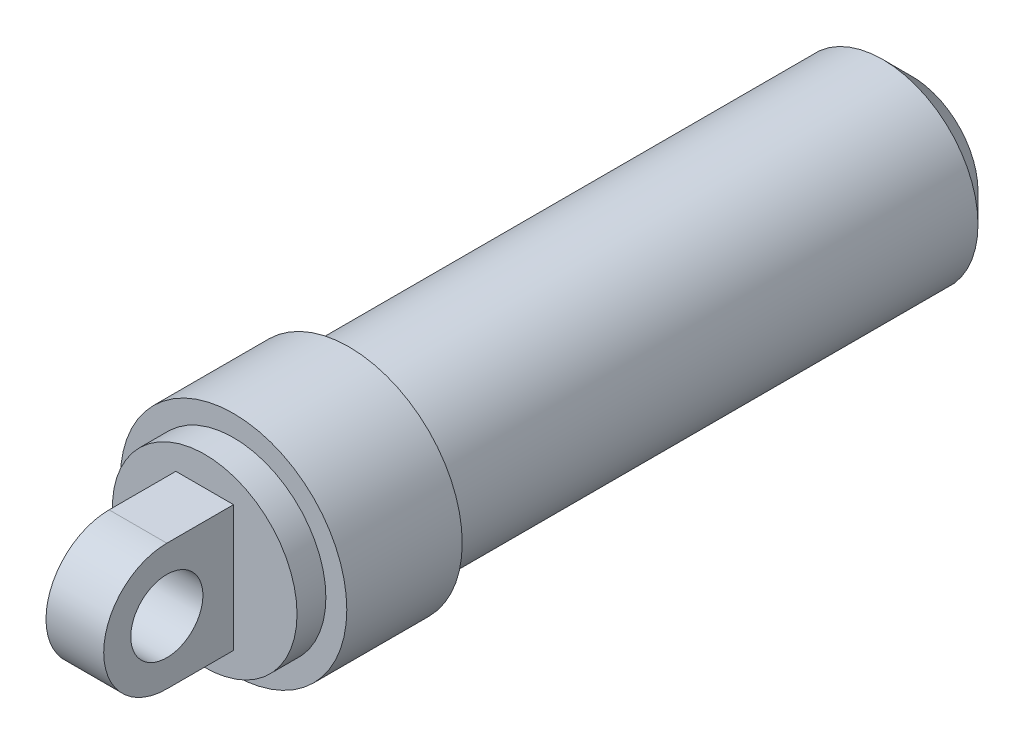
ISO-10303-21;
HEADER;
FILE_DESCRIPTION(('STEP AP214'),'2;1');
FILE_NAME('part.step','',(''),(''),'','','');
FILE_SCHEMA(('AUTOMOTIVE_DESIGN { 1 0 10303 214 1 1 1 1 }'));
ENDSEC;
DATA;
#1=APPLICATION_CONTEXT('core data for automotive mechanical design processes');
#2=APPLICATION_PROTOCOL_DEFINITION('international standard','automotive_design',2000,#1);
#3=PRODUCT_CONTEXT('',#1,'mechanical');
#4=PRODUCT('Part','Part','',(#3));
#5=PRODUCT_RELATED_PRODUCT_CATEGORY('part','',(#4));
#6=PRODUCT_DEFINITION_FORMATION('','',#4);
#7=PRODUCT_DEFINITION_CONTEXT('part definition',#1,'design');
#8=PRODUCT_DEFINITION('design','',#6,#7);
#9=PRODUCT_DEFINITION_SHAPE('','',#8);
#10=(LENGTH_UNIT() NAMED_UNIT(*) SI_UNIT(.MILLI.,.METRE.));
#11=(NAMED_UNIT(*) PLANE_ANGLE_UNIT() SI_UNIT($,.RADIAN.));
#12=(NAMED_UNIT(*) SI_UNIT($,.STERADIAN.) SOLID_ANGLE_UNIT());
#13=UNCERTAINTY_MEASURE_WITH_UNIT(LENGTH_MEASURE(1.E-05),#10,'distance_accuracy_value','');
#14=(GEOMETRIC_REPRESENTATION_CONTEXT(3) GLOBAL_UNCERTAINTY_ASSIGNED_CONTEXT((#13)) GLOBAL_UNIT_ASSIGNED_CONTEXT((#10,
#11,#12)) REPRESENTATION_CONTEXT('',''));
#15=CARTESIAN_POINT('',(0.,0.,0.));
#16=DIRECTION('',(0.,0.,1.));
#17=DIRECTION('',(1.,0.,0.));
#18=AXIS2_PLACEMENT_3D('',#15,#16,#17);
#19=CARTESIAN_POINT('',(0.,0.,49.));
#20=DIRECTION('',(0.,0.,1.));
#21=DIRECTION('',(1.,0.,0.));
#22=AXIS2_PLACEMENT_3D('',#19,#20,#21);
#23=PLANE('',#22);
#24=CARTESIAN_POINT('',(0.,0.,49.));
#25=DIRECTION('',(0.,0.,1.));
#26=DIRECTION('',(1.,0.,0.));
#27=AXIS2_PLACEMENT_3D('',#24,#25,#26);
#28=CIRCLE('',#27,6.4);
#29=CARTESIAN_POINT('',(6.4,0.,49.));
#30=VERTEX_POINT('',#29);
#31=EDGE_CURVE('E99',#30,#30,#28,.T.);
#32=ORIENTED_EDGE('',*,*,#31,.T.);
#33=EDGE_LOOP('',(#32));
#34=FACE_BOUND('',#33,.T.);
#35=DIRECTION('',(-1.,0.,0.));
#36=VECTOR('',#35,1.);
#37=CARTESIAN_POINT('',(2.,4.375,49.));
#38=LINE('',#37,#36);
#39=CARTESIAN_POINT('',(2.,4.375,49.));
#40=VERTEX_POINT('',#39);
#41=CARTESIAN_POINT('',(-2.,4.375,49.));
#42=VERTEX_POINT('',#41);
#43=EDGE_CURVE('E54',#40,#42,#38,.T.);
#44=ORIENTED_EDGE('',*,*,#43,.F.);
#45=DIRECTION('',(0.,1.,0.));
#46=VECTOR('',#45,1.);
#47=CARTESIAN_POINT('',(2.,-4.375,49.));
#48=LINE('',#47,#46);
#49=CARTESIAN_POINT('',(2.,-4.375,49.));
#50=VERTEX_POINT('',#49);
#51=EDGE_CURVE('E49',#50,#40,#48,.T.);
#52=ORIENTED_EDGE('',*,*,#51,.F.);
#53=DIRECTION('',(-1.,0.,0.));
#54=VECTOR('',#53,1.);
#55=CARTESIAN_POINT('',(2.,-4.375,49.));
#56=LINE('',#55,#54);
#57=CARTESIAN_POINT('',(-2.,-4.375,49.));
#58=VERTEX_POINT('',#57);
#59=EDGE_CURVE('E80',#50,#58,#56,.T.);
#60=ORIENTED_EDGE('',*,*,#59,.T.);
#61=DIRECTION('',(0.,1.,0.));
#62=VECTOR('',#61,1.);
#63=CARTESIAN_POINT('',(-2.,-4.375,49.));
#64=LINE('',#63,#62);
#65=EDGE_CURVE('E300',#58,#42,#64,.T.);
#66=ORIENTED_EDGE('',*,*,#65,.T.);
#67=EDGE_LOOP('',(#44,#52,#60,#66));
#68=FACE_BOUND('',#67,.T.);
#69=ADVANCED_FACE('F34',(#34,#68),#23,.T.);
#70=CARTESIAN_POINT('',(0.,0.,39.));
#71=DIRECTION('',(0.,0.,-1.));
#72=DIRECTION('',(-1.,0.,0.));
#73=AXIS2_PLACEMENT_3D('',#70,#71,#72);
#74=CYLINDRICAL_SURFACE('',#73,6.6);
#75=CARTESIAN_POINT('',(0.,0.,2.00000000000001));
#76=DIRECTION('',(0.,0.,1.));
#77=DIRECTION('',(1.,0.,0.));
#78=AXIS2_PLACEMENT_3D('',#75,#76,#77);
#79=CIRCLE('',#78,6.6);
#80=CARTESIAN_POINT('',(6.6,0.,2.00000000000001));
#81=VERTEX_POINT('',#80);
#82=EDGE_CURVE('E42',#81,#81,#79,.T.);
#83=ORIENTED_EDGE('',*,*,#82,.T.);
#84=EDGE_LOOP('',(#83));
#85=FACE_BOUND('',#84,.T.);
#86=CARTESIAN_POINT('',(0.,0.,39.));
#87=DIRECTION('',(0.,0.,1.));
#88=DIRECTION('',(1.,0.,0.));
#89=AXIS2_PLACEMENT_3D('',#86,#87,#88);
#90=CIRCLE('',#89,6.6);
#91=CARTESIAN_POINT('',(6.6,0.,39.));
#92=VERTEX_POINT('',#91);
#93=EDGE_CURVE('E110',#92,#92,#90,.T.);
#94=ORIENTED_EDGE('',*,*,#93,.F.);
#95=EDGE_LOOP('',(#94));
#96=FACE_BOUND('',#95,.T.);
#97=ADVANCED_FACE('F117',(#85,#96),#74,.T.);
#98=CARTESIAN_POINT('',(0.,0.,0.));
#99=DIRECTION('',(0.,0.,1.));
#100=DIRECTION('',(1.,0.,0.));
#101=AXIS2_PLACEMENT_3D('',#98,#99,#100);
#102=PLANE('',#101);
#103=CARTESIAN_POINT('',(0.,0.,0.));
#104=DIRECTION('',(0.,0.,-1.));
#105=DIRECTION('',(-1.,0.,0.));
#106=AXIS2_PLACEMENT_3D('',#103,#104,#105);
#107=CIRCLE('',#106,1.5);
#108=CARTESIAN_POINT('',(-1.5,0.,0.));
#109=VERTEX_POINT('',#108);
#110=EDGE_CURVE('E284',#109,#109,#107,.T.);
#111=ORIENTED_EDGE('',*,*,#110,.F.);
#112=EDGE_LOOP('',(#111));
#113=FACE_BOUND('',#112,.T.);
#114=CARTESIAN_POINT('',(0.,0.,0.));
#115=DIRECTION('',(0.,0.,1.));
#116=DIRECTION('',(1.,0.,0.));
#117=AXIS2_PLACEMENT_3D('',#114,#115,#116);
#118=CIRCLE('',#117,4.59999999999999);
#119=CARTESIAN_POINT('',(4.59999999999999,0.,0.));
#120=VERTEX_POINT('',#119);
#121=EDGE_CURVE('E11',#120,#120,#118,.F.);
#122=ORIENTED_EDGE('',*,*,#121,.T.);
#123=EDGE_LOOP('',(#122));
#124=FACE_BOUND('',#123,.T.);
#125=ADVANCED_FACE('F122',(#113,#124),#102,.F.);
#126=CARTESIAN_POINT('',(0.,0.,2.00000000000001));
#127=DIRECTION('',(0.,0.,1.));
#128=DIRECTION('',(1.,0.,0.));
#129=AXIS2_PLACEMENT_3D('',#126,#127,#128);
#130=CONICAL_SURFACE('',#129,6.6,0.785398163397449);
#131=ORIENTED_EDGE('',*,*,#121,.F.);
#132=EDGE_LOOP('',(#131));
#133=FACE_BOUND('',#132,.T.);
#134=ORIENTED_EDGE('',*,*,#82,.F.);
#135=EDGE_LOOP('',(#134));
#136=FACE_BOUND('',#135,.T.);
#137=ADVANCED_FACE('F36',(#133,#136),#130,.T.);
#138=CARTESIAN_POINT('',(0.,0.,47.));
#139=DIRECTION('',(0.,0.,-1.));
#140=DIRECTION('',(-1.,0.,0.));
#141=AXIS2_PLACEMENT_3D('',#138,#139,#140);
#142=CYLINDRICAL_SURFACE('',#141,7.85);
#143=CARTESIAN_POINT('',(0.,0.,47.));
#144=DIRECTION('',(0.,0.,1.));
#145=DIRECTION('',(1.,0.,0.));
#146=AXIS2_PLACEMENT_3D('',#143,#144,#145);
#147=CIRCLE('',#146,7.85);
#148=CARTESIAN_POINT('',(7.85,0.,47.));
#149=VERTEX_POINT('',#148);
#150=EDGE_CURVE('E107',#149,#149,#147,.T.);
#151=ORIENTED_EDGE('',*,*,#150,.F.);
#152=EDGE_LOOP('',(#151));
#153=FACE_BOUND('',#152,.T.);
#154=CARTESIAN_POINT('',(0.,0.,39.));
#155=DIRECTION('',(0.,0.,1.));
#156=DIRECTION('',(1.,0.,0.));
#157=AXIS2_PLACEMENT_3D('',#154,#155,#156);
#158=CIRCLE('',#157,7.85);
#159=CARTESIAN_POINT('',(7.85,0.,39.));
#160=VERTEX_POINT('',#159);
#161=EDGE_CURVE('E105',#160,#160,#158,.T.);
#162=ORIENTED_EDGE('',*,*,#161,.T.);
#163=EDGE_LOOP('',(#162));
#164=FACE_BOUND('',#163,.T.);
#165=ADVANCED_FACE('F121',(#153,#164),#142,.T.);
#166=CARTESIAN_POINT('',(0.,0.,47.));
#167=DIRECTION('',(0.,0.,1.));
#168=DIRECTION('',(1.,0.,0.));
#169=AXIS2_PLACEMENT_3D('',#166,#167,#168);
#170=PLANE('',#169);
#171=CARTESIAN_POINT('',(0.,0.,47.));
#172=DIRECTION('',(0.,0.,1.));
#173=DIRECTION('',(1.,0.,0.));
#174=AXIS2_PLACEMENT_3D('',#171,#172,#173);
#175=CIRCLE('',#174,6.4);
#176=CARTESIAN_POINT('',(6.4,0.,47.));
#177=VERTEX_POINT('',#176);
#178=EDGE_CURVE('E96',#177,#177,#175,.T.);
#179=ORIENTED_EDGE('',*,*,#178,.F.);
#180=EDGE_LOOP('',(#179));
#181=FACE_BOUND('',#180,.T.);
#182=ORIENTED_EDGE('',*,*,#150,.T.);
#183=EDGE_LOOP('',(#182));
#184=FACE_BOUND('',#183,.T.);
#185=ADVANCED_FACE('F128',(#181,#184),#170,.T.);
#186=CARTESIAN_POINT('',(0.,0.,39.));
#187=DIRECTION('',(0.,0.,1.));
#188=DIRECTION('',(1.,0.,0.));
#189=AXIS2_PLACEMENT_3D('',#186,#187,#188);
#190=PLANE('',#189);
#191=ORIENTED_EDGE('',*,*,#93,.T.);
#192=EDGE_LOOP('',(#191));
#193=FACE_BOUND('',#192,.T.);
#194=ORIENTED_EDGE('',*,*,#161,.F.);
#195=EDGE_LOOP('',(#194));
#196=FACE_BOUND('',#195,.T.);
#197=ADVANCED_FACE('F146',(#193,#196),#190,.F.);
#198=CARTESIAN_POINT('',(0.,0.,49.));
#199=DIRECTION('',(0.,0.,-1.));
#200=DIRECTION('',(-1.,0.,0.));
#201=AXIS2_PLACEMENT_3D('',#198,#199,#200);
#202=CYLINDRICAL_SURFACE('',#201,6.4);
#203=ORIENTED_EDGE('',*,*,#31,.F.);
#204=EDGE_LOOP('',(#203));
#205=FACE_BOUND('',#204,.T.);
#206=ORIENTED_EDGE('',*,*,#178,.T.);
#207=EDGE_LOOP('',(#206));
#208=FACE_BOUND('',#207,.T.);
#209=ADVANCED_FACE('F143',(#205,#208),#202,.T.);
#210=CARTESIAN_POINT('',(2.,0.,53.625));
#211=DIRECTION('',(-1.,0.,0.));
#212=DIRECTION('',(0.,0.,1.));
#213=AXIS2_PLACEMENT_3D('',#210,#211,#212);
#214=CYLINDRICAL_SURFACE('',#213,4.375);
#215=CARTESIAN_POINT('',(-2.,0.,53.625));
#216=DIRECTION('',(1.,0.,0.));
#217=DIRECTION('',(0.,0.,1.));
#218=AXIS2_PLACEMENT_3D('',#215,#216,#217);
#219=CIRCLE('',#218,4.375);
#220=CARTESIAN_POINT('',(-2.,4.375,53.625));
#221=VERTEX_POINT('',#220);
#222=CARTESIAN_POINT('',(-2.,-4.375,53.625));
#223=VERTEX_POINT('',#222);
#224=EDGE_CURVE('E95',#221,#223,#219,.T.);
#225=ORIENTED_EDGE('',*,*,#224,.T.);
#226=DIRECTION('',(-1.,0.,0.));
#227=VECTOR('',#226,1.);
#228=CARTESIAN_POINT('',(2.,-4.375,53.625));
#229=LINE('',#228,#227);
#230=CARTESIAN_POINT('',(2.,-4.375,53.625));
#231=VERTEX_POINT('',#230);
#232=EDGE_CURVE('E78',#231,#223,#229,.T.);
#233=ORIENTED_EDGE('',*,*,#232,.F.);
#234=CARTESIAN_POINT('',(2.,0.,53.625));
#235=DIRECTION('',(1.,0.,0.));
#236=DIRECTION('',(0.,0.,1.));
#237=AXIS2_PLACEMENT_3D('',#234,#235,#236);
#238=CIRCLE('',#237,4.375);
#239=CARTESIAN_POINT('',(2.,4.375,53.625));
#240=VERTEX_POINT('',#239);
#241=EDGE_CURVE('E82',#240,#231,#238,.T.);
#242=ORIENTED_EDGE('',*,*,#241,.F.);
#243=DIRECTION('',(-1.,0.,0.));
#244=VECTOR('',#243,1.);
#245=CARTESIAN_POINT('',(2.,4.375,53.625));
#246=LINE('',#245,#244);
#247=EDGE_CURVE('E296',#240,#221,#246,.T.);
#248=ORIENTED_EDGE('',*,*,#247,.T.);
#249=EDGE_LOOP('',(#225,#233,#242,#248));
#250=FACE_BOUND('',#249,.T.);
#251=ADVANCED_FACE('F93',(#250),#214,.T.);
#252=CARTESIAN_POINT('',(2.,-4.375,53.625));
#253=DIRECTION('',(0.,1.,0.));
#254=DIRECTION('',(0.,0.,1.));
#255=AXIS2_PLACEMENT_3D('',#252,#253,#254);
#256=PLANE('',#255);
#257=DIRECTION('',(0.,0.,-1.));
#258=VECTOR('',#257,1.);
#259=CARTESIAN_POINT('',(-2.,-4.375,53.625));
#260=LINE('',#259,#258);
#261=EDGE_CURVE('E298',#223,#58,#260,.T.);
#262=ORIENTED_EDGE('',*,*,#261,.T.);
#263=ORIENTED_EDGE('',*,*,#59,.F.);
#264=DIRECTION('',(0.,0.,-1.));
#265=VECTOR('',#264,1.);
#266=CARTESIAN_POINT('',(2.,-4.375,53.625));
#267=LINE('',#266,#265);
#268=EDGE_CURVE('E73',#231,#50,#267,.T.);
#269=ORIENTED_EDGE('',*,*,#268,.F.);
#270=ORIENTED_EDGE('',*,*,#232,.T.);
#271=EDGE_LOOP('',(#262,#263,#269,#270));
#272=FACE_BOUND('',#271,.T.);
#273=ADVANCED_FACE('F76',(#272),#256,.F.);
#274=CARTESIAN_POINT('',(2.,4.375,49.));
#275=DIRECTION('',(0.,-1.,0.));
#276=DIRECTION('',(0.,0.,-1.));
#277=AXIS2_PLACEMENT_3D('',#274,#275,#276);
#278=PLANE('',#277);
#279=DIRECTION('',(0.,0.,1.));
#280=VECTOR('',#279,1.);
#281=CARTESIAN_POINT('',(-2.,4.375,49.));
#282=LINE('',#281,#280);
#283=EDGE_CURVE('E91',#42,#221,#282,.T.);
#284=ORIENTED_EDGE('',*,*,#283,.T.);
#285=ORIENTED_EDGE('',*,*,#247,.F.);
#286=DIRECTION('',(0.,0.,1.));
#287=VECTOR('',#286,1.);
#288=CARTESIAN_POINT('',(2.,4.375,49.));
#289=LINE('',#288,#287);
#290=EDGE_CURVE('E87',#40,#240,#289,.T.);
#291=ORIENTED_EDGE('',*,*,#290,.F.);
#292=ORIENTED_EDGE('',*,*,#43,.T.);
#293=EDGE_LOOP('',(#284,#285,#291,#292));
#294=FACE_BOUND('',#293,.T.);
#295=ADVANCED_FACE('F177',(#294),#278,.F.);
#296=CARTESIAN_POINT('',(2.,0.,53.625));
#297=DIRECTION('',(-1.,0.,0.));
#298=DIRECTION('',(0.,0.,1.));
#299=AXIS2_PLACEMENT_3D('',#296,#297,#298);
#300=PLANE('',#299);
#301=CARTESIAN_POINT('',(2.,0.,53.625));
#302=DIRECTION('',(-1.,0.,0.));
#303=DIRECTION('',(0.,0.,1.));
#304=AXIS2_PLACEMENT_3D('',#301,#302,#303);
#305=CIRCLE('',#304,2.5);
#306=CARTESIAN_POINT('',(2.,0.,56.125));
#307=VERTEX_POINT('',#306);
#308=EDGE_CURVE('E287',#307,#307,#305,.T.);
#309=ORIENTED_EDGE('',*,*,#308,.T.);
#310=EDGE_LOOP('',(#309));
#311=FACE_BOUND('',#310,.T.);
#312=ORIENTED_EDGE('',*,*,#241,.T.);
#313=ORIENTED_EDGE('',*,*,#268,.T.);
#314=ORIENTED_EDGE('',*,*,#51,.T.);
#315=ORIENTED_EDGE('',*,*,#290,.T.);
#316=EDGE_LOOP('',(#312,#313,#314,#315));
#317=FACE_BOUND('',#316,.T.);
#318=ADVANCED_FACE('F85',(#311,#317),#300,.F.);
#319=CARTESIAN_POINT('',(-2.,0.,53.625));
#320=DIRECTION('',(-1.,0.,0.));
#321=DIRECTION('',(0.,0.,1.));
#322=AXIS2_PLACEMENT_3D('',#319,#320,#321);
#323=PLANE('',#322);
#324=CARTESIAN_POINT('',(-2.,0.,53.625));
#325=DIRECTION('',(-1.,0.,0.));
#326=DIRECTION('',(0.,0.,1.));
#327=AXIS2_PLACEMENT_3D('',#324,#325,#326);
#328=CIRCLE('',#327,2.5);
#329=CARTESIAN_POINT('',(-2.,0.,56.125));
#330=VERTEX_POINT('',#329);
#331=EDGE_CURVE('E283',#330,#330,#328,.T.);
#332=ORIENTED_EDGE('',*,*,#331,.F.);
#333=EDGE_LOOP('',(#332));
#334=FACE_BOUND('',#333,.T.);
#335=ORIENTED_EDGE('',*,*,#224,.F.);
#336=ORIENTED_EDGE('',*,*,#283,.F.);
#337=ORIENTED_EDGE('',*,*,#65,.F.);
#338=ORIENTED_EDGE('',*,*,#261,.F.);
#339=EDGE_LOOP('',(#335,#336,#337,#338));
#340=FACE_BOUND('',#339,.T.);
#341=ADVANCED_FACE('F190',(#334,#340),#323,.T.);
#342=CARTESIAN_POINT('',(2.,0.,53.625));
#343=DIRECTION('',(-1.,0.,0.));
#344=DIRECTION('',(0.,0.,1.));
#345=AXIS2_PLACEMENT_3D('',#342,#343,#344);
#346=CYLINDRICAL_SURFACE('',#345,2.5);
#347=ORIENTED_EDGE('',*,*,#308,.F.);
#348=EDGE_LOOP('',(#347));
#349=FACE_BOUND('',#348,.T.);
#350=ORIENTED_EDGE('',*,*,#331,.T.);
#351=EDGE_LOOP('',(#350));
#352=FACE_BOUND('',#351,.T.);
#353=ADVANCED_FACE('F198',(#349,#352),#346,.F.);
#354=CARTESIAN_POINT('',(0.,0.,35.));
#355=DIRECTION('',(0.,0.,-1.));
#356=DIRECTION('',(-1.,0.,0.));
#357=AXIS2_PLACEMENT_3D('',#354,#355,#356);
#358=CYLINDRICAL_SURFACE('',#357,1.5);
#359=CARTESIAN_POINT('',(0.,0.,35.));
#360=DIRECTION('',(0.,0.,-1.));
#361=DIRECTION('',(-1.,0.,0.));
#362=AXIS2_PLACEMENT_3D('',#359,#360,#361);
#363=CIRCLE('',#362,1.5);
#364=CARTESIAN_POINT('',(-1.5,0.,35.));
#365=VERTEX_POINT('',#364);
#366=EDGE_CURVE('E282',#365,#365,#363,.T.);
#367=ORIENTED_EDGE('',*,*,#366,.F.);
#368=EDGE_LOOP('',(#367));
#369=FACE_BOUND('',#368,.T.);
#370=ORIENTED_EDGE('',*,*,#110,.T.);
#371=EDGE_LOOP('',(#370));
#372=FACE_BOUND('',#371,.T.);
#373=ADVANCED_FACE('F206',(#369,#372),#358,.F.);
#374=CARTESIAN_POINT('',(0.,0.,35.));
#375=DIRECTION('',(0.,0.,-1.));
#376=DIRECTION('',(-1.,0.,0.));
#377=AXIS2_PLACEMENT_3D('',#374,#375,#376);
#378=PLANE('',#377);
#379=ORIENTED_EDGE('',*,*,#366,.T.);
#380=EDGE_LOOP('',(#379));
#381=FACE_BOUND('',#380,.T.);
#382=ADVANCED_FACE('F215',(#381),#378,.T.);
#383=CLOSED_SHELL('',(#69,#97,#125,#137,#165,#185,#197,#209,#251,#273,#295,#318,#341,#353,#373,#382));
#384=MANIFOLD_SOLID_BREP('B2',#383);
#385=ADVANCED_BREP_SHAPE_REPRESENTATION('',(#18,#384),#14);
#386=SHAPE_DEFINITION_REPRESENTATION(#9,#385);
ENDSEC;
END-ISO-10303-21;
